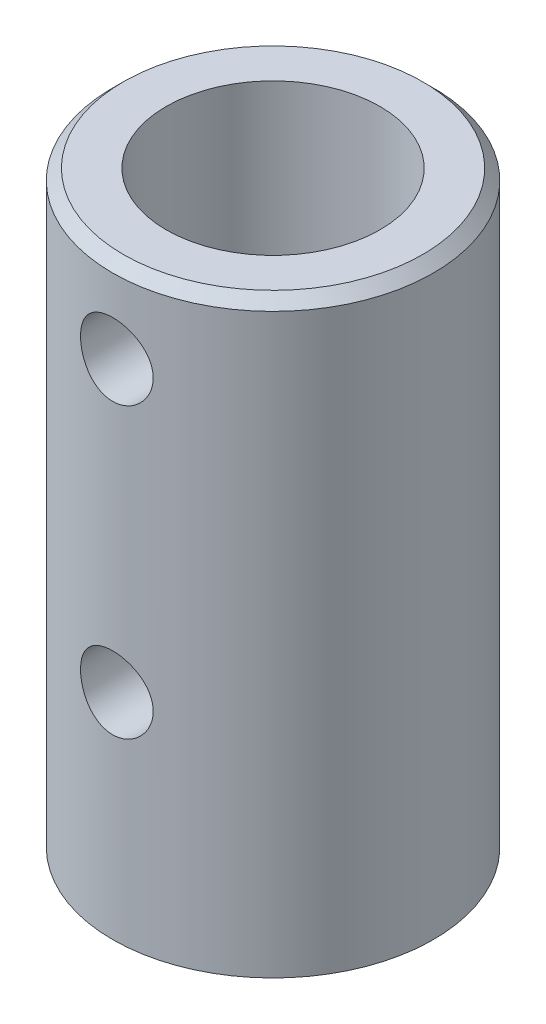
ISO-10303-21;
HEADER;
FILE_DESCRIPTION(('STEP AP214'),'2;1');
FILE_NAME('part.step','',(''),(''),'','','');
FILE_SCHEMA(('AUTOMOTIVE_DESIGN { 1 0 10303 214 1 1 1 1 }'));
ENDSEC;
DATA;
#1=APPLICATION_CONTEXT('core data for automotive mechanical design processes');
#2=APPLICATION_PROTOCOL_DEFINITION('international standard','automotive_design',2000,#1);
#3=PRODUCT_CONTEXT('',#1,'mechanical');
#4=PRODUCT('Part','Part','',(#3));
#5=PRODUCT_RELATED_PRODUCT_CATEGORY('part','',(#4));
#6=PRODUCT_DEFINITION_FORMATION('','',#4);
#7=PRODUCT_DEFINITION_CONTEXT('part definition',#1,'design');
#8=PRODUCT_DEFINITION('design','',#6,#7);
#9=PRODUCT_DEFINITION_SHAPE('','',#8);
#10=(LENGTH_UNIT() NAMED_UNIT(*) SI_UNIT(.MILLI.,.METRE.));
#11=(NAMED_UNIT(*) PLANE_ANGLE_UNIT() SI_UNIT($,.RADIAN.));
#12=(NAMED_UNIT(*) SI_UNIT($,.STERADIAN.) SOLID_ANGLE_UNIT());
#13=UNCERTAINTY_MEASURE_WITH_UNIT(LENGTH_MEASURE(1.E-05),#10,'distance_accuracy_value','');
#14=(GEOMETRIC_REPRESENTATION_CONTEXT(3) GLOBAL_UNCERTAINTY_ASSIGNED_CONTEXT((#13)) GLOBAL_UNIT_ASSIGNED_CONTEXT((#10,
#11,#12)) REPRESENTATION_CONTEXT('',''));
#15=CARTESIAN_POINT('',(0.,0.,0.));
#16=DIRECTION('',(0.,0.,1.));
#17=DIRECTION('',(1.,0.,0.));
#18=AXIS2_PLACEMENT_3D('',#15,#16,#17);
#19=CARTESIAN_POINT('',(0.,55.,0.));
#20=DIRECTION('',(0.,1.,0.));
#21=DIRECTION('',(0.,0.,1.));
#22=AXIS2_PLACEMENT_3D('',#19,#20,#21);
#23=PLANE('',#22);
#24=CARTESIAN_POINT('',(0.,55.,0.));
#25=DIRECTION('',(0.,1.,0.));
#26=DIRECTION('',(0.,0.,1.));
#27=AXIS2_PLACEMENT_3D('',#24,#25,#26);
#28=CIRCLE('',#27,14.);
#29=CARTESIAN_POINT('',(0.,55.,14.));
#30=VERTEX_POINT('',#29);
#31=EDGE_CURVE('E40',#30,#30,#28,.T.);
#32=ORIENTED_EDGE('',*,*,#31,.T.);
#33=EDGE_LOOP('',(#32));
#34=FACE_BOUND('',#33,.T.);
#35=CARTESIAN_POINT('',(0.,55.,0.));
#36=DIRECTION('',(0.,1.,0.));
#37=DIRECTION('',(0.,0.,1.));
#38=AXIS2_PLACEMENT_3D('',#35,#36,#37);
#39=CIRCLE('',#38,10.);
#40=CARTESIAN_POINT('',(0.,55.,10.));
#41=VERTEX_POINT('',#40);
#42=EDGE_CURVE('E48',#41,#41,#39,.T.);
#43=ORIENTED_EDGE('',*,*,#42,.F.);
#44=EDGE_LOOP('',(#43));
#45=FACE_BOUND('',#44,.T.);
#46=ADVANCED_FACE('F33',(#34,#45),#23,.T.);
#47=CARTESIAN_POINT('',(0.,0.,0.));
#48=DIRECTION('',(0.,1.,0.));
#49=DIRECTION('',(0.,0.,1.));
#50=AXIS2_PLACEMENT_3D('',#47,#48,#49);
#51=PLANE('',#50);
#52=CARTESIAN_POINT('',(0.,0.,0.));
#53=DIRECTION('',(0.,1.,0.));
#54=DIRECTION('',(0.,0.,1.));
#55=AXIS2_PLACEMENT_3D('',#52,#53,#54);
#56=CIRCLE('',#55,15.);
#57=CARTESIAN_POINT('',(0.,0.,15.));
#58=VERTEX_POINT('',#57);
#59=EDGE_CURVE('E44',#58,#58,#56,.T.);
#60=ORIENTED_EDGE('',*,*,#59,.F.);
#61=EDGE_LOOP('',(#60));
#62=FACE_BOUND('',#61,.T.);
#63=CARTESIAN_POINT('',(0.,0.,0.));
#64=DIRECTION('',(0.,1.,0.));
#65=DIRECTION('',(0.,0.,1.));
#66=AXIS2_PLACEMENT_3D('',#63,#64,#65);
#67=CIRCLE('',#66,10.);
#68=CARTESIAN_POINT('',(0.,0.,10.));
#69=VERTEX_POINT('',#68);
#70=EDGE_CURVE('E51',#69,#69,#67,.T.);
#71=ORIENTED_EDGE('',*,*,#70,.T.);
#72=EDGE_LOOP('',(#71));
#73=FACE_BOUND('',#72,.T.);
#74=ADVANCED_FACE('F88',(#62,#73),#51,.F.);
#75=CARTESIAN_POINT('',(0.,55.,0.));
#76=DIRECTION('',(0.,-1.,0.));
#77=DIRECTION('',(0.,0.,-1.));
#78=AXIS2_PLACEMENT_3D('',#75,#76,#77);
#79=CYLINDRICAL_SURFACE('',#78,15.);
#80=CARTESIAN_POINT('',(0.,54.,0.));
#81=DIRECTION('',(0.,1.,0.));
#82=DIRECTION('',(0.,0.,1.));
#83=AXIS2_PLACEMENT_3D('',#80,#81,#82);
#84=CIRCLE('',#83,15.);
#85=CARTESIAN_POINT('',(0.,54.,15.));
#86=VERTEX_POINT('',#85);
#87=EDGE_CURVE('E10',#86,#86,#84,.F.);
#88=ORIENTED_EDGE('',*,*,#87,.T.);
#89=EDGE_LOOP('',(#88));
#90=FACE_BOUND('',#89,.T.);
#91=CARTESIAN_POINT('',(3.4,47.,14.6095858941997));
#92=CARTESIAN_POINT('',(3.39999376782481,46.8116716752223,14.6095896889351));
#93=CARTESIAN_POINT('',(3.38429930452047,46.6232699639035,14.6132671207341));
#94=CARTESIAN_POINT('',(3.32201232954985,46.2518370086333,14.6275499713983));
#95=CARTESIAN_POINT('',(3.27539854332107,46.0688095531428,14.6381601603892));
#96=CARTESIAN_POINT('',(3.15282654770924,45.7135515601774,14.6650465284109));
#97=CARTESIAN_POINT('',(3.07690190069511,45.5413089347575,14.6813162249282));
#98=CARTESIAN_POINT('',(2.89796109139546,45.2119985596822,14.7176805646095));
#99=CARTESIAN_POINT('',(2.79494506606037,45.0549307333218,14.7377751884377));
#100=CARTESIAN_POINT('',(2.56275429844639,44.7575799558276,14.7799323774868));
#101=CARTESIAN_POINT('',(2.43318060991031,44.6176122617798,14.8020216771521));
#102=CARTESIAN_POINT('',(2.15241343120678,44.3611999015948,14.8454457913539));
#103=CARTESIAN_POINT('',(2.00121818389829,44.2447571491401,14.866780544394));
#104=CARTESIAN_POINT('',(1.67937478527212,44.0374425871596,14.9065840251699));
#105=CARTESIAN_POINT('',(1.50852556221798,43.9468755832849,14.9250175255874));
#106=CARTESIAN_POINT('',(1.15354387174962,43.7958577345586,14.9566388265606));
#107=CARTESIAN_POINT('',(0.969413010317031,43.7354032555431,14.9698272600843));
#108=CARTESIAN_POINT('',(0.596375096152564,43.6473225217523,14.9892835082931));
#109=CARTESIAN_POINT('',(0.407600100758753,43.6191622419417,14.9956637773744));
#110=CARTESIAN_POINT('',(0.0279047203995547,43.594798003314,15.0011749819951));
#111=CARTESIAN_POINT('',(-0.163015398893668,43.5985901298455,15.0003068055786));
#112=CARTESIAN_POINT('',(-0.537894715822564,43.6376286241736,14.9915043437542));
#113=CARTESIAN_POINT('',(-0.721917361778899,43.6722991930692,14.9836994154229));
#114=CARTESIAN_POINT('',(-1.08146229580584,43.7711909265775,14.9620485601526));
#115=CARTESIAN_POINT('',(-1.2569841809959,43.83541349025,14.9482023472068));
#116=CARTESIAN_POINT('',(-1.59612379446789,43.992084826448,14.9158191012335));
#117=CARTESIAN_POINT('',(-1.75963866703669,44.0847485993869,14.8972465287841));
#118=CARTESIAN_POINT('',(-2.06900575758318,44.2955110264499,14.8574418730095));
#119=CARTESIAN_POINT('',(-2.21485539971982,44.4136133829213,14.8362094027495));
#120=CARTESIAN_POINT('',(-2.48817919695255,44.6750239964802,14.7928553200624));
#121=CARTESIAN_POINT('',(-2.61517044859789,44.818836095137,14.7707244398681));
#122=CARTESIAN_POINT('',(-2.84332790261735,45.1259455692131,14.7285093767463));
#123=CARTESIAN_POINT('',(-2.94449329610946,45.2892435547075,14.7084252579365));
#124=CARTESIAN_POINT('',(-3.11836423157087,45.631509952594,14.672550882238));
#125=CARTESIAN_POINT('',(-3.19097253308115,45.8105294106679,14.6567753513943));
#126=CARTESIAN_POINT('',(-3.30492553643786,46.178672669236,14.6315040169311));
#127=CARTESIAN_POINT('',(-3.3462756060662,46.3677947288983,14.6220071351532));
#128=CARTESIAN_POINT('',(-3.39577685090457,46.7463461948602,14.6105898877196));
#129=CARTESIAN_POINT('',(-3.40463379284858,46.9356785638295,14.6085084835821));
#130=CARTESIAN_POINT('',(-3.39081335528201,47.3131146388446,14.6117224884195));
#131=CARTESIAN_POINT('',(-3.36813831608595,47.5012184350344,14.6170173499255));
#132=CARTESIAN_POINT('',(-3.29251156717882,47.868361350728,14.6342346594769));
#133=CARTESIAN_POINT('',(-3.23995388861148,48.0474860597121,14.646070798759));
#134=CARTESIAN_POINT('',(-3.1064828667081,48.3943862777747,14.6749581829937));
#135=CARTESIAN_POINT('',(-3.02556664645806,48.5621606333227,14.6920099570391));
#136=CARTESIAN_POINT('',(-2.83613951323727,48.8846364640487,14.7297575329817));
#137=CARTESIAN_POINT('',(-2.72719692857646,49.0390777622286,14.7505086197646));
#138=CARTESIAN_POINT('',(-2.48536971253807,49.3277459134325,14.793173429252));
#139=CARTESIAN_POINT('',(-2.35248187683556,49.4619700566021,14.8150873072826));
#140=CARTESIAN_POINT('',(-2.06333149284457,49.7091619636512,14.8581430377868));
#141=CARTESIAN_POINT('',(-1.90665183091261,49.821646811891,14.8792604301129));
#142=CARTESIAN_POINT('',(-1.5762118771656,50.0187008140316,14.9178813859088));
#143=CARTESIAN_POINT('',(-1.40245241299587,50.1032713197283,14.9353851243601));
#144=CARTESIAN_POINT('',(-1.04390552536521,50.2414378604569,14.9647040845393));
#145=CARTESIAN_POINT('',(-0.859199919407158,50.2952379187314,14.9765566867089));
#146=CARTESIAN_POINT('',(-0.483071388267593,50.370968479262,14.9934000658609));
#147=CARTESIAN_POINT('',(-0.291649520747554,50.3929039766114,14.9983919183288));
#148=CARTESIAN_POINT('',(0.0879054109659141,50.4040443349864,15.0009165073062));
#149=CARTESIAN_POINT('',(0.276016640239963,50.3939680783632,14.9986130763352));
#150=CARTESIAN_POINT('',(0.647790207085551,50.3429882751318,14.9871598986928));
#151=CARTESIAN_POINT('',(0.831452636331763,50.3020853643152,14.978010293222));
#152=CARTESIAN_POINT('',(1.18851106802967,50.1909683898969,14.953908236082));
#153=CARTESIAN_POINT('',(1.36194249184258,50.1208631710454,14.9389773472002));
#154=CARTESIAN_POINT('',(1.69467315845671,49.9534352055899,14.904901435264));
#155=CARTESIAN_POINT('',(1.85397092035499,49.8561096113034,14.8857559713431));
#156=CARTESIAN_POINT('',(2.15739616695258,49.6346961783374,14.8448502226933));
#157=CARTESIAN_POINT('',(2.30115174114915,49.5101069574447,14.8230448905703));
#158=CARTESIAN_POINT('',(2.56596060913404,49.2387052490115,14.7795093470474));
#159=CARTESIAN_POINT('',(2.68700836553138,49.0918873566537,14.7577791552355));
#160=CARTESIAN_POINT('',(2.90467665942898,48.7776173034876,14.7164988199034));
#161=CARTESIAN_POINT('',(3.00091484212325,48.6098952278327,14.6969851285273));
#162=CARTESIAN_POINT('',(3.16368458336583,48.2602465815014,14.6628124496324));
#163=CARTESIAN_POINT('',(3.2302404510107,48.0783317783316,14.6481494920313));
#164=CARTESIAN_POINT('',(3.32034349962777,47.7469532579148,14.6279499826937));
#165=CARTESIAN_POINT('',(3.35015558743851,47.5992405597064,14.6211105784065));
#166=CARTESIAN_POINT('',(3.38998577141035,47.3010341000713,14.6119271440095));
#167=CARTESIAN_POINT('',(3.40000498169749,47.1505404956609,14.609582860873));
#168=CARTESIAN_POINT('',(3.4,47.,14.6095858941997));
#169=B_SPLINE_CURVE_WITH_KNOTS('',3,(#91,#92,#93,#94,#95,#96,#97,#98,#99,#100,#101,#102,#103,
#104,#105,#106,#107,#108,#109,#110,#111,#112,#113,#114,#115,#116,#117,#118,#119,#120,#121,#122,
#123,#124,#125,#126,#127,#128,#129,#130,#131,#132,#133,#134,#135,#136,#137,#138,#139,#140,#141,
#142,#143,#144,#145,#146,#147,#148,#149,#150,#151,#152,#153,#154,#155,#156,#157,#158,#159,#160,
#161,#162,#163,#164,#165,#166,#167,#168),.UNSPECIFIED.,.T.,.F.,(4,2,2,2,2,2,2,2,2,2,2,2,2,2,2,2,
2,2,2,2,2,2,2,2,2,2,2,2,2,2,2,2,2,2,2,2,2,2,4),(0.,0.564433000666016,1.12925477241682,
1.69343170477739,2.25760578520556,2.8309741586832,3.40438915517573,3.98430377384506,
4.56414838789677,5.13425964158809,5.70430104907136,6.26393025163286,6.82358595106182,
7.38758113323899,7.95165845515621,8.52832831418532,9.10501623265943,9.68365118767347,
10.2621867547162,10.8280792491605,11.39392974511,11.9524864766556,12.5110998890088,
13.0788943173931,13.6467647838544,14.2260800033104,14.805367164398,15.3807674589853,
15.9560775440037,16.51856007193,17.0810309991223,17.6414239458736,18.2018755405486,
18.7736604742459,19.3455846592215,19.9258571960532,20.5056536271045,20.9568592919536,
21.4080395580549),.UNSPECIFIED.);
#170=CARTESIAN_POINT('',(3.4,47.,14.6095858941997));
#171=VERTEX_POINT('',#170);
#172=EDGE_CURVE('E105',#171,#171,#169,.T.);
#173=ORIENTED_EDGE('',*,*,#172,.T.);
#174=EDGE_LOOP('',(#173));
#175=FACE_BOUND('',#174,.T.);
#176=CARTESIAN_POINT('',(3.4,20.,14.6095858941997));
#177=CARTESIAN_POINT('',(3.39999376782481,19.8116716752223,14.6095896889351));
#178=CARTESIAN_POINT('',(3.38429930452047,19.6232699639035,14.6132671207341));
#179=CARTESIAN_POINT('',(3.32201232954984,19.2518370086333,14.6275499713983));
#180=CARTESIAN_POINT('',(3.27539854332107,19.0688095531428,14.6381601603892));
#181=CARTESIAN_POINT('',(3.15282654770924,18.7135515601774,14.6650465284109));
#182=CARTESIAN_POINT('',(3.0769019006951,18.5413089347575,14.6813162249282));
#183=CARTESIAN_POINT('',(2.89796109139546,18.2119985596822,14.7176805646095));
#184=CARTESIAN_POINT('',(2.79494506606037,18.0549307333218,14.7377751884377));
#185=CARTESIAN_POINT('',(2.56275429844638,17.7575799558276,14.7799323774868));
#186=CARTESIAN_POINT('',(2.4331806099103,17.6176122617798,14.8020216771521));
#187=CARTESIAN_POINT('',(2.15241343120678,17.3611999015948,14.8454457913539));
#188=CARTESIAN_POINT('',(2.00121818389829,17.2447571491401,14.866780544394));
#189=CARTESIAN_POINT('',(1.67937478527212,17.0374425871596,14.9065840251699));
#190=CARTESIAN_POINT('',(1.50852556221798,16.9468755832849,14.9250175255874));
#191=CARTESIAN_POINT('',(1.15354387174961,16.7958577345586,14.9566388265606));
#192=CARTESIAN_POINT('',(0.969413010317028,16.7354032555431,14.9698272600843));
#193=CARTESIAN_POINT('',(0.59637509615256,16.6473225217523,14.9892835082931));
#194=CARTESIAN_POINT('',(0.407600100758749,16.6191622419417,14.9956637773744));
#195=CARTESIAN_POINT('',(0.0279047203995506,16.594798003314,15.0011749819951));
#196=CARTESIAN_POINT('',(-0.163015398893673,16.5985901298455,15.0003068055786));
#197=CARTESIAN_POINT('',(-0.537894715822568,16.6376286241736,14.9915043437542));
#198=CARTESIAN_POINT('',(-0.721917361778904,16.6722991930692,14.9836994154229));
#199=CARTESIAN_POINT('',(-1.08146229580585,16.7711909265775,14.9620485601526));
#200=CARTESIAN_POINT('',(-1.2569841809959,16.83541349025,14.9482023472068));
#201=CARTESIAN_POINT('',(-1.5961237944679,16.992084826448,14.9158191012335));
#202=CARTESIAN_POINT('',(-1.75963866703669,17.0847485993869,14.8972465287841));
#203=CARTESIAN_POINT('',(-2.06900575758319,17.2955110264499,14.8574418730095));
#204=CARTESIAN_POINT('',(-2.21485539971983,17.4136133829213,14.8362094027495));
#205=CARTESIAN_POINT('',(-2.48817919695255,17.6750239964802,14.7928553200624));
#206=CARTESIAN_POINT('',(-2.61517044859789,17.818836095137,14.7707244398681));
#207=CARTESIAN_POINT('',(-2.84332790261735,18.1259455692131,14.7285093767463));
#208=CARTESIAN_POINT('',(-2.94449329610946,18.2892435547075,14.7084252579365));
#209=CARTESIAN_POINT('',(-3.11836423157087,18.631509952594,14.672550882238));
#210=CARTESIAN_POINT('',(-3.19097253308115,18.8105294106679,14.6567753513943));
#211=CARTESIAN_POINT('',(-3.30492553643786,19.178672669236,14.6315040169311));
#212=CARTESIAN_POINT('',(-3.3462756060662,19.3677947288983,14.6220071351532));
#213=CARTESIAN_POINT('',(-3.39577685090457,19.7463461948602,14.6105898877196));
#214=CARTESIAN_POINT('',(-3.40463379284858,19.9356785638295,14.6085084835821));
#215=CARTESIAN_POINT('',(-3.39081335528201,20.3131146388446,14.6117224884195));
#216=CARTESIAN_POINT('',(-3.36813831608595,20.5012184350344,14.6170173499255));
#217=CARTESIAN_POINT('',(-3.29251156717881,20.868361350728,14.6342346594769));
#218=CARTESIAN_POINT('',(-3.23995388861148,21.0474860597122,14.646070798759));
#219=CARTESIAN_POINT('',(-3.1064828667081,21.3943862777747,14.6749581829937));
#220=CARTESIAN_POINT('',(-3.02556664645806,21.5621606333227,14.6920099570391));
#221=CARTESIAN_POINT('',(-2.83613951323727,21.8846364640487,14.7297575329817));
#222=CARTESIAN_POINT('',(-2.72719692857646,22.0390777622286,14.7505086197646));
#223=CARTESIAN_POINT('',(-2.48536971253806,22.3277459134325,14.793173429252));
#224=CARTESIAN_POINT('',(-2.35248187683556,22.4619700566021,14.8150873072826));
#225=CARTESIAN_POINT('',(-2.06333149284457,22.7091619636512,14.8581430377868));
#226=CARTESIAN_POINT('',(-1.9066518309126,22.821646811891,14.8792604301129));
#227=CARTESIAN_POINT('',(-1.57621187716559,23.0187008140316,14.9178813859088));
#228=CARTESIAN_POINT('',(-1.40245241299587,23.1032713197283,14.9353851243601));
#229=CARTESIAN_POINT('',(-1.0439055253652,23.2414378604569,14.9647040845393));
#230=CARTESIAN_POINT('',(-0.859199919407152,23.2952379187314,14.9765566867089));
#231=CARTESIAN_POINT('',(-0.483071388267588,23.3709684792621,14.9934000658609));
#232=CARTESIAN_POINT('',(-0.291649520747549,23.3929039766114,14.9983919183288));
#233=CARTESIAN_POINT('',(0.0879054109659188,23.4040443349864,15.0009165073062));
#234=CARTESIAN_POINT('',(0.276016640239968,23.3939680783632,14.9986130763352));
#235=CARTESIAN_POINT('',(0.647790207085555,23.3429882751318,14.9871598986928));
#236=CARTESIAN_POINT('',(0.831452636331767,23.3020853643152,14.978010293222));
#237=CARTESIAN_POINT('',(1.18851106802967,23.1909683898969,14.953908236082));
#238=CARTESIAN_POINT('',(1.36194249184258,23.1208631710454,14.9389773472002));
#239=CARTESIAN_POINT('',(1.69467315845671,22.9534352055899,14.904901435264));
#240=CARTESIAN_POINT('',(1.85397092035499,22.8561096113034,14.8857559713431));
#241=CARTESIAN_POINT('',(2.15739616695259,22.6346961783374,14.8448502226933));
#242=CARTESIAN_POINT('',(2.30115174114915,22.5101069574447,14.8230448905703));
#243=CARTESIAN_POINT('',(2.56596060913404,22.2387052490115,14.7795093470474));
#244=CARTESIAN_POINT('',(2.68700836553138,22.0918873566537,14.7577791552355));
#245=CARTESIAN_POINT('',(2.90467665942898,21.7776173034875,14.7164988199034));
#246=CARTESIAN_POINT('',(3.00091484212325,21.6098952278327,14.6969851285273));
#247=CARTESIAN_POINT('',(3.16368458336583,21.2602465815014,14.6628124496324));
#248=CARTESIAN_POINT('',(3.23024045101071,21.0783317783316,14.6481494920313));
#249=CARTESIAN_POINT('',(3.32034349962777,20.7469532579148,14.6279499826937));
#250=CARTESIAN_POINT('',(3.35015558743851,20.5992405597064,14.6211105784065));
#251=CARTESIAN_POINT('',(3.38998577141035,20.3010341000712,14.6119271440095));
#252=CARTESIAN_POINT('',(3.40000498169749,20.1505404956609,14.609582860873));
#253=CARTESIAN_POINT('',(3.4,20.,14.6095858941997));
#254=B_SPLINE_CURVE_WITH_KNOTS('',3,(#176,#177,#178,#179,#180,#181,#182,#183,#184,#185,#186,
#187,#188,#189,#190,#191,#192,#193,#194,#195,#196,#197,#198,#199,#200,#201,#202,#203,#204,#205,
#206,#207,#208,#209,#210,#211,#212,#213,#214,#215,#216,#217,#218,#219,#220,#221,#222,#223,#224,
#225,#226,#227,#228,#229,#230,#231,#232,#233,#234,#235,#236,#237,#238,#239,#240,#241,#242,#243,
#244,#245,#246,#247,#248,#249,#250,#251,#252,#253),.UNSPECIFIED.,.T.,.F.,(4,2,2,2,2,2,2,2,2,2,2,
2,2,2,2,2,2,2,2,2,2,2,2,2,2,2,2,2,2,2,2,2,2,2,2,2,2,2,4),(0.,0.564433000666023,1.12925477241683,
1.6934317047774,2.25760578520556,2.8309741586832,3.40438915517573,3.98430377384506,
4.56414838789678,5.13425964158809,5.70430104907136,6.26393025163286,6.82358595106182,
7.38758113323899,7.95165845515621,8.52832831418533,9.10501623265944,9.68365118767347,
10.2621867547162,10.8280792491605,11.39392974511,11.9524864766556,12.5110998890088,
13.0788943173932,13.6467647838544,14.2260800033104,14.805367164398,15.3807674589853,
15.9560775440037,16.51856007193,17.0810309991224,17.6414239458736,18.2018755405486,
18.7736604742459,19.3455846592215,19.9258571960532,20.5056536271046,20.9568592919536,
21.4080395580549),.UNSPECIFIED.);
#255=CARTESIAN_POINT('',(3.4,20.,14.6095858941997));
#256=VERTEX_POINT('',#255);
#257=EDGE_CURVE('E54',#256,#256,#254,.T.);
#258=ORIENTED_EDGE('',*,*,#257,.T.);
#259=EDGE_LOOP('',(#258));
#260=FACE_BOUND('',#259,.T.);
#261=ORIENTED_EDGE('',*,*,#59,.T.);
#262=EDGE_LOOP('',(#261));
#263=FACE_BOUND('',#262,.T.);
#264=ADVANCED_FACE('F69',(#90,#175,#260,#263),#79,.T.);
#265=CARTESIAN_POINT('',(0.,55.,0.));
#266=DIRECTION('',(0.,-1.,0.));
#267=DIRECTION('',(0.,0.,-1.));
#268=AXIS2_PLACEMENT_3D('',#265,#266,#267);
#269=CYLINDRICAL_SURFACE('',#268,10.);
#270=CARTESIAN_POINT('',(3.4,47.,9.404254356407));
#271=CARTESIAN_POINT('',(3.4000016690875,46.8150465795166,9.40425304388512));
#272=CARTESIAN_POINT('',(3.38485741847302,46.6301044888814,9.40977016252886));
#273=CARTESIAN_POINT('',(3.32489550119485,46.2657144754948,9.43112195412395));
#274=CARTESIAN_POINT('',(3.28007392801337,46.0862672793074,9.44695798538134));
#275=CARTESIAN_POINT('',(3.16252582092778,45.738207830887,9.486950978287));
#276=CARTESIAN_POINT('',(3.08985577794442,45.5695744458786,9.51109108494812));
#277=CARTESIAN_POINT('',(2.9188677257369,45.246836091663,9.56494733634185));
#278=CARTESIAN_POINT('',(2.82054370734523,45.0927345379101,9.59466478704886));
#279=CARTESIAN_POINT('',(2.59674934389342,44.7971582709235,9.65768445866952));
#280=CARTESIAN_POINT('',(2.47040953086171,44.6563613040691,9.69107860913661));
#281=CARTESIAN_POINT('',(2.19602382297906,44.3974887025967,9.75691356862043));
#282=CARTESIAN_POINT('',(2.04797428884779,44.2794168851682,9.78935421670139));
#283=CARTESIAN_POINT('',(1.72938686572475,44.0662424510808,9.85069566679235));
#284=CARTESIAN_POINT('',(1.558345814726,43.9718540131291,9.87947581186828));
#285=CARTESIAN_POINT('',(1.20166651255448,43.8134591911092,9.92916704916357));
#286=CARTESIAN_POINT('',(1.01603238201038,43.7494442661766,9.95008035315213));
#287=CARTESIAN_POINT('',(0.642545447140163,43.6559238520096,9.98103018889156));
#288=CARTESIAN_POINT('',(0.455014419274269,43.6252564523288,9.99143197500353));
#289=CARTESIAN_POINT('',(0.0771989450662063,43.5956028243666,10.0014854948076));
#290=CARTESIAN_POINT('',(-0.113084749891808,43.5966081077474,10.001140108762));
#291=CARTESIAN_POINT('',(-0.482764195543964,43.6295435022879,9.98998341494102));
#292=CARTESIAN_POINT('',(-0.662287492900007,43.6602106911517,9.97959952787043));
#293=CARTESIAN_POINT('',(-1.01346851094143,43.7495054138351,9.95007286837142));
#294=CARTESIAN_POINT('',(-1.18512569243208,43.8081348612366,9.93092949649604));
#295=CARTESIAN_POINT('',(-1.5184131226844,43.9524033040308,9.88550014200623));
#296=CARTESIAN_POINT('',(-1.67987806725566,44.0383939094485,9.85912183117114));
#297=CARTESIAN_POINT('',(-1.98645327362911,44.2346510085855,9.80195684021073));
#298=CARTESIAN_POINT('',(-2.13155884324518,44.3449244404432,9.77116890103817));
#299=CARTESIAN_POINT('',(-2.4087999391923,44.5929396241193,9.7066438580778));
#300=CARTESIAN_POINT('',(-2.53995535189234,44.7317602142449,9.67283615811297));
#301=CARTESIAN_POINT('',(-2.77744986140759,45.0297020898752,9.60734023658844));
#302=CARTESIAN_POINT('',(-2.88378480516894,45.1888267658562,9.57565237035916));
#303=CARTESIAN_POINT('',(-3.07005178456859,45.5260799429684,9.51758814230447));
#304=CARTESIAN_POINT('',(-3.14955318699025,45.7044627991994,9.49130084065409));
#305=CARTESIAN_POINT('',(-3.27705071712164,46.0732045766816,9.4480434513369));
#306=CARTESIAN_POINT('',(-3.32506069134676,46.2635581940891,9.43106926930757));
#307=CARTESIAN_POINT('',(-3.3861816778386,46.6413120770272,9.4092923936097));
#308=CARTESIAN_POINT('',(-3.40081833232185,46.8284348482265,9.40395811354865));
#309=CARTESIAN_POINT('',(-3.39911130614408,47.2024992361776,9.40457603744577));
#310=CARTESIAN_POINT('',(-3.3827735480466,47.3894408807242,9.4105260837476));
#311=CARTESIAN_POINT('',(-3.32095449786326,47.7507671043703,9.43251068789196));
#312=CARTESIAN_POINT('',(-3.27655084034138,47.9253612335103,9.44817196310352));
#313=CARTESIAN_POINT('',(-3.16116303149791,48.2645794300234,9.48739880028367));
#314=CARTESIAN_POINT('',(-3.09017404940011,48.4292016791026,9.51096579870722));
#315=CARTESIAN_POINT('',(-2.92099798407743,48.7497675045382,9.56430135308215));
#316=CARTESIAN_POINT('',(-2.82199797208764,48.9052517259236,9.59424738815656));
#317=CARTESIAN_POINT('',(-2.6005224379063,49.197950976233,9.65662979681133));
#318=CARTESIAN_POINT('',(-2.47803972836567,49.3351603899405,9.68906693101563));
#319=CARTESIAN_POINT('',(-2.20575180115405,49.5945638357725,9.75475318078119));
#320=CARTESIAN_POINT('',(-2.05488096449369,49.7156531552402,9.78796087549967));
#321=CARTESIAN_POINT('',(-1.73414271302249,49.9308767146915,9.84984194395065));
#322=CARTESIAN_POINT('',(-1.56427588871584,50.0250117922439,9.87851545856462));
#323=CARTESIAN_POINT('',(-1.21112598499962,50.1828176281521,9.92797706666075));
#324=CARTESIAN_POINT('',(-1.02793408215332,50.2466764101315,9.94881365774702));
#325=CARTESIAN_POINT('',(-0.652559201917857,50.3424010933565,9.98045984572127));
#326=CARTESIAN_POINT('',(-0.460379644955189,50.3742790634789,9.99127322503842));
#327=CARTESIAN_POINT('',(-0.0825694640888734,50.4040167793745,10.001357736856));
#328=CARTESIAN_POINT('',(0.102923536813657,50.4034595510511,10.0011659900752));
#329=CARTESIAN_POINT('',(0.471049997402426,50.3722732051303,9.99059617297391));
#330=CARTESIAN_POINT('',(0.653683703668661,50.341646695324,9.9802189859969));
#331=CARTESIAN_POINT('',(1.00778986749219,50.252253127282,9.95064937449839));
#332=CARTESIAN_POINT('',(1.17939969818483,50.1939757513976,9.93161057522011));
#333=CARTESIAN_POINT('',(1.5104652509288,50.0513926574057,9.88667962779269));
#334=CARTESIAN_POINT('',(1.66991874005479,49.9670821717273,9.86078622445031));
#335=CARTESIAN_POINT('',(1.978731924377,49.7711575093756,9.80358215465496));
#336=CARTESIAN_POINT('',(2.12748087355313,49.6586304284057,9.77210349983335));
#337=CARTESIAN_POINT('',(2.40449800466575,49.4110014575927,9.70765952419128));
#338=CARTESIAN_POINT('',(2.53275949305274,49.2758922192155,9.6746937219911));
#339=CARTESIAN_POINT('',(2.7705421613379,48.980285541935,9.60936753123022));
#340=CARTESIAN_POINT('',(2.87907383901402,48.8189716020654,9.57708800752135));
#341=CARTESIAN_POINT('',(3.06742609789491,48.4793823069565,9.51843865442494));
#342=CARTESIAN_POINT('',(3.14725272451975,48.3011105331302,9.49206758113118));
#343=CARTESIAN_POINT('',(3.27340630756408,47.9383484843869,9.44929298428447));
#344=CARTESIAN_POINT('',(3.32071740887073,47.7542359735091,9.43259928285847));
#345=CARTESIAN_POINT('',(3.38400738702497,47.3800767847314,9.4100827285858));
#346=CARTESIAN_POINT('',(3.39999828507781,47.1900324120416,9.40425570497194));
#347=CARTESIAN_POINT('',(3.4,47.,9.404254356407));
#348=B_SPLINE_CURVE_WITH_KNOTS('',3,(#270,#271,#272,#273,#274,#275,#276,#277,#278,#279,#280,
#281,#282,#283,#284,#285,#286,#287,#288,#289,#290,#291,#292,#293,#294,#295,#296,#297,#298,#299,
#300,#301,#302,#303,#304,#305,#306,#307,#308,#309,#310,#311,#312,#313,#314,#315,#316,#317,#318,
#319,#320,#321,#322,#323,#324,#325,#326,#327,#328,#329,#330,#331,#332,#333,#334,#335,#336,#337,
#338,#339,#340,#341,#342,#343,#344,#345,#346,#347),.UNSPECIFIED.,.T.,.F.,(4,2,2,2,2,2,2,2,2,2,2,
2,2,2,2,2,2,2,2,2,2,2,2,2,2,2,2,2,2,2,2,2,2,2,2,2,2,2,4),(0.,0.554155936307689,1.10838483238169,
1.66149536988459,2.21473558407237,2.78843620567122,3.36223310898811,3.95167753488287,
4.54095611388211,5.10897071265925,5.6768330837675,6.22153553621675,6.7662752704326,
7.3183190052706,7.8705206762951,8.44970265346113,9.02898147216688,9.6171579547036,
10.2050756473347,10.7655266587632,11.3258705181363,11.8659072222685,12.406042103245,
12.9638264324961,13.5217817561255,14.1078464903068,14.693893011298,15.2762507491977,
15.8583886349397,16.4121398132912,16.965842971211,17.5100868450775,18.0544304481672,
18.6193838234416,19.1845214012716,19.7729365795805,20.3612277621793,20.9308199934137,
21.500193562978),.UNSPECIFIED.);
#349=CARTESIAN_POINT('',(3.4,47.,9.404254356407));
#350=VERTEX_POINT('',#349);
#351=EDGE_CURVE('E109',#350,#350,#348,.T.);
#352=ORIENTED_EDGE('',*,*,#351,.F.);
#353=EDGE_LOOP('',(#352));
#354=FACE_BOUND('',#353,.T.);
#355=CARTESIAN_POINT('',(3.4,20.,9.404254356407));
#356=CARTESIAN_POINT('',(3.4000016690875,19.8150465795166,9.40425304388512));
#357=CARTESIAN_POINT('',(3.38485741847302,19.6301044888814,9.40977016252886));
#358=CARTESIAN_POINT('',(3.32489550119485,19.2657144754948,9.43112195412395));
#359=CARTESIAN_POINT('',(3.28007392801337,19.0862672793074,9.44695798538134));
#360=CARTESIAN_POINT('',(3.16252582092778,18.738207830887,9.486950978287));
#361=CARTESIAN_POINT('',(3.08985577794442,18.5695744458786,9.51109108494812));
#362=CARTESIAN_POINT('',(2.9188677257369,18.246836091663,9.56494733634185));
#363=CARTESIAN_POINT('',(2.82054370734523,18.0927345379101,9.59466478704886));
#364=CARTESIAN_POINT('',(2.59674934389341,17.7971582709235,9.65768445866953));
#365=CARTESIAN_POINT('',(2.4704095308617,17.6563613040691,9.69107860913661));
#366=CARTESIAN_POINT('',(2.19602382297905,17.3974887025967,9.75691356862043));
#367=CARTESIAN_POINT('',(2.04797428884779,17.2794168851682,9.78935421670139));
#368=CARTESIAN_POINT('',(1.72938686572475,17.0662424510808,9.85069566679235));
#369=CARTESIAN_POINT('',(1.558345814726,16.9718540131291,9.87947581186828));
#370=CARTESIAN_POINT('',(1.20166651255447,16.8134591911092,9.92916704916357));
#371=CARTESIAN_POINT('',(1.01603238201037,16.7494442661766,9.95008035315213));
#372=CARTESIAN_POINT('',(0.642545447140158,16.6559238520096,9.98103018889156));
#373=CARTESIAN_POINT('',(0.455014419274265,16.6252564523288,9.99143197500353));
#374=CARTESIAN_POINT('',(0.0771989450662024,16.5956028243666,10.0014854948076));
#375=CARTESIAN_POINT('',(-0.113084749891811,16.5966081077474,10.001140108762));
#376=CARTESIAN_POINT('',(-0.482764195543966,16.6295435022879,9.98998341494102));
#377=CARTESIAN_POINT('',(-0.662287492900009,16.6602106911517,9.97959952787043));
#378=CARTESIAN_POINT('',(-1.01346851094143,16.7495054138351,9.95007286837142));
#379=CARTESIAN_POINT('',(-1.18512569243209,16.8081348612366,9.93092949649604));
#380=CARTESIAN_POINT('',(-1.51841312268439,16.9524033040308,9.88550014200623));
#381=CARTESIAN_POINT('',(-1.67987806725566,17.0383939094485,9.85912183117114));
#382=CARTESIAN_POINT('',(-1.98645327362911,17.2346510085855,9.80195684021073));
#383=CARTESIAN_POINT('',(-2.13155884324518,17.3449244404432,9.77116890103816));
#384=CARTESIAN_POINT('',(-2.4087999391923,17.5929396241193,9.70664385807779));
#385=CARTESIAN_POINT('',(-2.53995535189234,17.7317602142449,9.67283615811297));
#386=CARTESIAN_POINT('',(-2.77744986140759,18.0297020898752,9.60734023658844));
#387=CARTESIAN_POINT('',(-2.88378480516894,18.1888267658563,9.57565237035916));
#388=CARTESIAN_POINT('',(-3.07005178456859,18.5260799429684,9.51758814230447));
#389=CARTESIAN_POINT('',(-3.14955318699024,18.7044627991994,9.49130084065409));
#390=CARTESIAN_POINT('',(-3.27705071712164,19.0732045766816,9.4480434513369));
#391=CARTESIAN_POINT('',(-3.32506069134676,19.2635581940891,9.43106926930757));
#392=CARTESIAN_POINT('',(-3.3861816778386,19.6413120770272,9.4092923936097));
#393=CARTESIAN_POINT('',(-3.40081833232185,19.8284348482265,9.40395811354865));
#394=CARTESIAN_POINT('',(-3.39911130614408,20.2024992361776,9.40457603744577));
#395=CARTESIAN_POINT('',(-3.3827735480466,20.3894408807242,9.4105260837476));
#396=CARTESIAN_POINT('',(-3.32095449786326,20.7507671043703,9.43251068789196));
#397=CARTESIAN_POINT('',(-3.27655084034137,20.9253612335103,9.44817196310352));
#398=CARTESIAN_POINT('',(-3.16116303149792,21.2645794300234,9.48739880028367));
#399=CARTESIAN_POINT('',(-3.09017404940011,21.4292016791026,9.51096579870722));
#400=CARTESIAN_POINT('',(-2.92099798407743,21.7497675045382,9.56430135308215));
#401=CARTESIAN_POINT('',(-2.82199797208764,21.9052517259236,9.59424738815656));
#402=CARTESIAN_POINT('',(-2.6005224379063,22.197950976233,9.65662979681133));
#403=CARTESIAN_POINT('',(-2.47803972836567,22.3351603899405,9.68906693101563));
#404=CARTESIAN_POINT('',(-2.20575180115406,22.5945638357725,9.75475318078119));
#405=CARTESIAN_POINT('',(-2.05488096449369,22.7156531552402,9.78796087549967));
#406=CARTESIAN_POINT('',(-1.73414271302249,22.9308767146915,9.84984194395065));
#407=CARTESIAN_POINT('',(-1.56427588871584,23.0250117922439,9.87851545856461));
#408=CARTESIAN_POINT('',(-1.21112598499961,23.1828176281521,9.92797706666075));
#409=CARTESIAN_POINT('',(-1.02793408215332,23.2466764101315,9.94881365774702));
#410=CARTESIAN_POINT('',(-0.652559201917854,23.3424010933565,9.98045984572127));
#411=CARTESIAN_POINT('',(-0.460379644955186,23.3742790634789,9.99127322503842));
#412=CARTESIAN_POINT('',(-0.0825694640888704,23.4040167793745,10.001357736856));
#413=CARTESIAN_POINT('',(0.102923536813659,23.4034595510511,10.0011659900752));
#414=CARTESIAN_POINT('',(0.471049997402429,23.3722732051303,9.99059617297391));
#415=CARTESIAN_POINT('',(0.653683703668664,23.341646695324,9.9802189859969));
#416=CARTESIAN_POINT('',(1.00778986749219,23.252253127282,9.95064937449839));
#417=CARTESIAN_POINT('',(1.17939969818483,23.1939757513976,9.93161057522011));
#418=CARTESIAN_POINT('',(1.51046525092881,23.0513926574057,9.88667962779269));
#419=CARTESIAN_POINT('',(1.66991874005479,22.9670821717273,9.86078622445031));
#420=CARTESIAN_POINT('',(1.978731924377,22.7711575093757,9.80358215465496));
#421=CARTESIAN_POINT('',(2.12748087355313,22.6586304284057,9.77210349983335));
#422=CARTESIAN_POINT('',(2.40449800466575,22.4110014575927,9.70765952419128));
#423=CARTESIAN_POINT('',(2.53275949305274,22.2758922192155,9.6746937219911));
#424=CARTESIAN_POINT('',(2.77054216133791,21.980285541935,9.60936753123022));
#425=CARTESIAN_POINT('',(2.87907383901402,21.8189716020654,9.57708800752135));
#426=CARTESIAN_POINT('',(3.06742609789491,21.4793823069565,9.51843865442494));
#427=CARTESIAN_POINT('',(3.14725272451975,21.3011105331302,9.49206758113118));
#428=CARTESIAN_POINT('',(3.27340630756408,20.938348484387,9.44929298428447));
#429=CARTESIAN_POINT('',(3.32071740887073,20.7542359735091,9.43259928285847));
#430=CARTESIAN_POINT('',(3.38400738702497,20.3800767847314,9.41008272858581));
#431=CARTESIAN_POINT('',(3.39999828507781,20.1900324120416,9.40425570497194));
#432=CARTESIAN_POINT('',(3.4,20.,9.404254356407));
#433=B_SPLINE_CURVE_WITH_KNOTS('',3,(#355,#356,#357,#358,#359,#360,#361,#362,#363,#364,#365,
#366,#367,#368,#369,#370,#371,#372,#373,#374,#375,#376,#377,#378,#379,#380,#381,#382,#383,#384,
#385,#386,#387,#388,#389,#390,#391,#392,#393,#394,#395,#396,#397,#398,#399,#400,#401,#402,#403,
#404,#405,#406,#407,#408,#409,#410,#411,#412,#413,#414,#415,#416,#417,#418,#419,#420,#421,#422,
#423,#424,#425,#426,#427,#428,#429,#430,#431,#432),.UNSPECIFIED.,.T.,.F.,(4,2,2,2,2,2,2,2,2,2,2,
2,2,2,2,2,2,2,2,2,2,2,2,2,2,2,2,2,2,2,2,2,2,2,2,2,2,2,4),(0.,0.554155936307696,1.1083848323817,
1.66149536988459,2.21473558407237,2.78843620567122,3.36223310898811,3.95167753488287,
4.54095611388212,5.10897071265926,5.67683308376751,6.22153553621676,6.7662752704326,
7.3183190052706,7.8705206762951,8.44970265346114,9.02898147216689,9.6171579547036,
10.2050756473347,10.7655266587632,11.3258705181364,11.8659072222685,12.406042103245,
12.9638264324961,13.5217817561255,14.1078464903068,14.693893011298,15.2762507491977,
15.8583886349397,16.4121398132912,16.965842971211,17.5100868450775,18.0544304481672,
18.6193838234416,19.1845214012716,19.7729365795805,20.3612277621793,20.9308199934137,
21.500193562978),.UNSPECIFIED.);
#434=CARTESIAN_POINT('',(3.4,20.,9.404254356407));
#435=VERTEX_POINT('',#434);
#436=EDGE_CURVE('E63',#435,#435,#433,.T.);
#437=ORIENTED_EDGE('',*,*,#436,.F.);
#438=EDGE_LOOP('',(#437));
#439=FACE_BOUND('',#438,.T.);
#440=ORIENTED_EDGE('',*,*,#42,.T.);
#441=EDGE_LOOP('',(#440));
#442=FACE_BOUND('',#441,.T.);
#443=ORIENTED_EDGE('',*,*,#70,.F.);
#444=EDGE_LOOP('',(#443));
#445=FACE_BOUND('',#444,.T.);
#446=ADVANCED_FACE('F77',(#354,#439,#442,#445),#269,.F.);
#447=CARTESIAN_POINT('',(0.,20.,15.));
#448=DIRECTION('',(0.,0.,1.));
#449=DIRECTION('',(1.,0.,0.));
#450=AXIS2_PLACEMENT_3D('',#447,#448,#449);
#451=CYLINDRICAL_SURFACE('',#450,3.4);
#452=ORIENTED_EDGE('',*,*,#436,.T.);
#453=EDGE_LOOP('',(#452));
#454=FACE_BOUND('',#453,.T.);
#455=ORIENTED_EDGE('',*,*,#257,.F.);
#456=EDGE_LOOP('',(#455));
#457=FACE_BOUND('',#456,.T.);
#458=ADVANCED_FACE('F72',(#454,#457),#451,.F.);
#459=CARTESIAN_POINT('',(0.,47.,15.));
#460=DIRECTION('',(0.,0.,1.));
#461=DIRECTION('',(1.,0.,0.));
#462=AXIS2_PLACEMENT_3D('',#459,#460,#461);
#463=CYLINDRICAL_SURFACE('',#462,3.4);
#464=ORIENTED_EDGE('',*,*,#351,.T.);
#465=EDGE_LOOP('',(#464));
#466=FACE_BOUND('',#465,.T.);
#467=ORIENTED_EDGE('',*,*,#172,.F.);
#468=EDGE_LOOP('',(#467));
#469=FACE_BOUND('',#468,.T.);
#470=ADVANCED_FACE('F76',(#466,#469),#463,.F.);
#471=CARTESIAN_POINT('',(0.,55.,0.));
#472=DIRECTION('',(0.,-1.,0.));
#473=DIRECTION('',(0.,0.,-1.));
#474=AXIS2_PLACEMENT_3D('',#471,#472,#473);
#475=CONICAL_SURFACE('',#474,14.,0.785398163397442);
#476=ORIENTED_EDGE('',*,*,#87,.F.);
#477=EDGE_LOOP('',(#476));
#478=FACE_BOUND('',#477,.T.);
#479=ORIENTED_EDGE('',*,*,#31,.F.);
#480=EDGE_LOOP('',(#479));
#481=FACE_BOUND('',#480,.T.);
#482=ADVANCED_FACE('F35',(#478,#481),#475,.T.);
#483=CLOSED_SHELL('',(#46,#74,#264,#446,#458,#470,#482));
#484=MANIFOLD_SOLID_BREP('B2',#483);
#485=ADVANCED_BREP_SHAPE_REPRESENTATION('',(#18,#484),#14);
#486=SHAPE_DEFINITION_REPRESENTATION(#9,#485);
ENDSEC;
END-ISO-10303-21;
